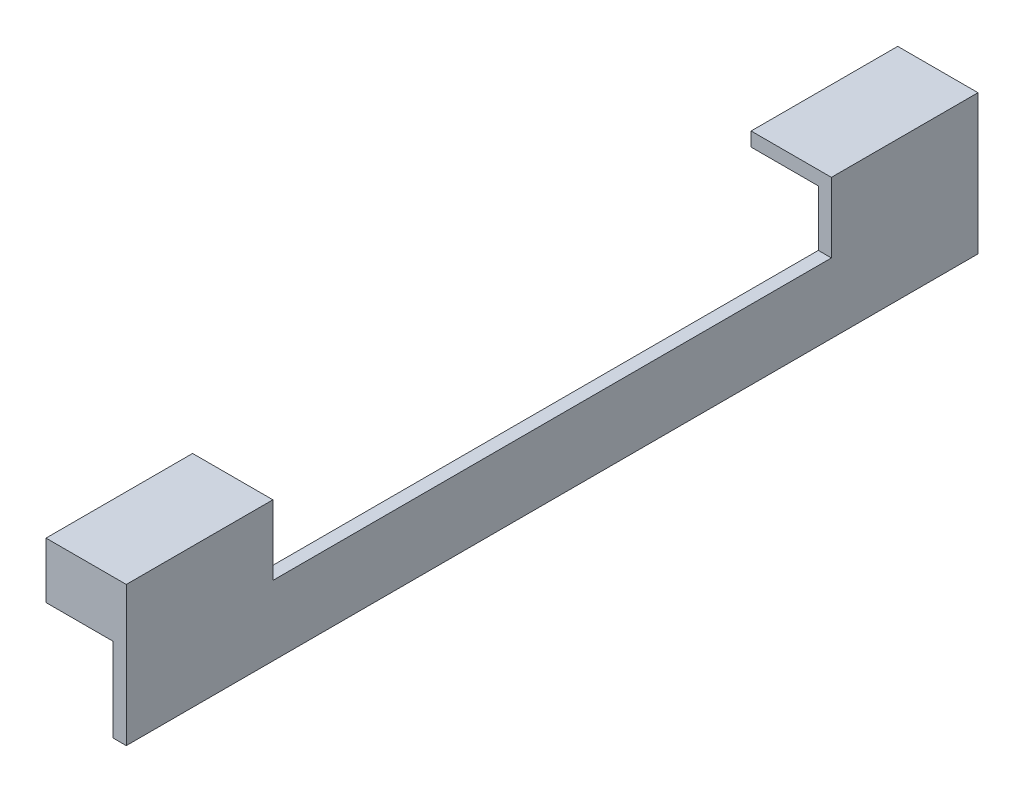
ISO-10303-21;
HEADER;
FILE_DESCRIPTION(('STEP AP214'),'2;1');
FILE_NAME('part.step','',(''),(''),'','','');
FILE_SCHEMA(('AUTOMOTIVE_DESIGN { 1 0 10303 214 1 1 1 1 }'));
ENDSEC;
DATA;
#1=APPLICATION_CONTEXT('core data for automotive mechanical design processes');
#2=APPLICATION_PROTOCOL_DEFINITION('international standard','automotive_design',2000,#1);
#3=PRODUCT_CONTEXT('',#1,'mechanical');
#4=PRODUCT('Part','Part','',(#3));
#5=PRODUCT_RELATED_PRODUCT_CATEGORY('part','',(#4));
#6=PRODUCT_DEFINITION_FORMATION('','',#4);
#7=PRODUCT_DEFINITION_CONTEXT('part definition',#1,'design');
#8=PRODUCT_DEFINITION('design','',#6,#7);
#9=PRODUCT_DEFINITION_SHAPE('','',#8);
#10=(LENGTH_UNIT() NAMED_UNIT(*) SI_UNIT(.MILLI.,.METRE.));
#11=(NAMED_UNIT(*) PLANE_ANGLE_UNIT() SI_UNIT($,.RADIAN.));
#12=(NAMED_UNIT(*) SI_UNIT($,.STERADIAN.) SOLID_ANGLE_UNIT());
#13=UNCERTAINTY_MEASURE_WITH_UNIT(LENGTH_MEASURE(1.E-05),#10,'distance_accuracy_value','');
#14=(GEOMETRIC_REPRESENTATION_CONTEXT(3) GLOBAL_UNCERTAINTY_ASSIGNED_CONTEXT((#13)) GLOBAL_UNIT_ASSIGNED_CONTEXT((#10,
#11,#12)) REPRESENTATION_CONTEXT('',''));
#15=CARTESIAN_POINT('',(0.,0.,0.));
#16=DIRECTION('',(0.,0.,1.));
#17=DIRECTION('',(1.,0.,0.));
#18=AXIS2_PLACEMENT_3D('',#15,#16,#17);
#19=CARTESIAN_POINT('',(105.0925,45.72,-154.94));
#20=DIRECTION('',(-1.,0.,0.));
#21=DIRECTION('',(0.,0.,1.));
#22=AXIS2_PLACEMENT_3D('',#19,#20,#21);
#23=PLANE('',#22);
#24=DIRECTION('',(0.,-1.,0.));
#25=VECTOR('',#24,1.);
#26=CARTESIAN_POINT('',(105.0925,50.8,101.6));
#27=LINE('',#26,#25);
#28=CARTESIAN_POINT('',(105.0925,50.8,101.6));
#29=VERTEX_POINT('',#28);
#30=CARTESIAN_POINT('',(105.0925,45.72,101.6));
#31=VERTEX_POINT('',#30);
#32=EDGE_CURVE('E232',#29,#31,#27,.T.);
#33=ORIENTED_EDGE('',*,*,#32,.T.);
#34=DIRECTION('',(0.,0.,1.));
#35=VECTOR('',#34,1.);
#36=CARTESIAN_POINT('',(105.0925,45.72,-154.94));
#37=LINE('',#36,#35);
#38=CARTESIAN_POINT('',(105.0925,45.72,150.1775));
#39=VERTEX_POINT('',#38);
#40=EDGE_CURVE('E183',#31,#39,#37,.T.);
#41=ORIENTED_EDGE('',*,*,#40,.T.);
#42=DIRECTION('',(0.,-1.,0.));
#43=VECTOR('',#42,1.);
#44=CARTESIAN_POINT('',(105.0925,50.8,150.1775));
#45=LINE('',#44,#43);
#46=CARTESIAN_POINT('',(105.0925,30.48,150.1775));
#47=VERTEX_POINT('',#46);
#48=EDGE_CURVE('E266',#39,#47,#45,.T.);
#49=ORIENTED_EDGE('',*,*,#48,.T.);
#50=DIRECTION('',(0.,0.,1.));
#51=VECTOR('',#50,1.);
#52=CARTESIAN_POINT('',(105.0925,30.48,150.1775));
#53=LINE('',#52,#51);
#54=CARTESIAN_POINT('',(105.0925,30.48,154.94));
#55=VERTEX_POINT('',#54);
#56=EDGE_CURVE('E259',#47,#55,#53,.T.);
#57=ORIENTED_EDGE('',*,*,#56,.T.);
#58=DIRECTION('',(0.,-1.,0.));
#59=VECTOR('',#58,1.);
#60=CARTESIAN_POINT('',(105.0925,45.72,154.94));
#61=LINE('',#60,#59);
#62=CARTESIAN_POINT('',(105.0925,50.8,154.94));
#63=VERTEX_POINT('',#62);
#64=EDGE_CURVE('E195',#63,#55,#61,.T.);
#65=ORIENTED_EDGE('',*,*,#64,.F.);
#66=DIRECTION('',(0.,0.,1.));
#67=VECTOR('',#66,1.);
#68=CARTESIAN_POINT('',(105.0925,50.8,-154.94));
#69=LINE('',#68,#67);
#70=EDGE_CURVE('E181',#29,#63,#69,.T.);
#71=ORIENTED_EDGE('',*,*,#70,.F.);
#72=EDGE_LOOP('',(#33,#41,#49,#57,#65,#71));
#73=FACE_BOUND('',#72,.T.);
#74=ADVANCED_FACE('F37',(#73),#23,.T.);
#75=CARTESIAN_POINT('',(0.,0.,-101.6));
#76=DIRECTION('',(0.,0.,1.));
#77=DIRECTION('',(1.,0.,0.));
#78=AXIS2_PLACEMENT_3D('',#75,#76,#77);
#79=PLANE('',#78);
#80=DIRECTION('',(0.,1.,0.));
#81=VECTOR('',#80,1.);
#82=CARTESIAN_POINT('',(129.54,0.,-101.6));
#83=LINE('',#82,#81);
#84=CARTESIAN_POINT('',(129.54,25.4,-101.6));
#85=VERTEX_POINT('',#84);
#86=CARTESIAN_POINT('',(129.54,45.72,-101.6));
#87=VERTEX_POINT('',#86);
#88=EDGE_CURVE('E214',#85,#87,#83,.T.);
#89=ORIENTED_EDGE('',*,*,#88,.F.);
#90=DIRECTION('',(1.,0.,0.));
#91=VECTOR('',#90,1.);
#92=CARTESIAN_POINT('',(105.0925,25.4,-101.6));
#93=LINE('',#92,#91);
#94=CARTESIAN_POINT('',(134.3025,25.4,-101.6));
#95=VERTEX_POINT('',#94);
#96=EDGE_CURVE('E153',#85,#95,#93,.T.);
#97=ORIENTED_EDGE('',*,*,#96,.T.);
#98=DIRECTION('',(0.,1.,0.));
#99=VECTOR('',#98,1.);
#100=CARTESIAN_POINT('',(134.3025,25.4,-101.6));
#101=LINE('',#100,#99);
#102=CARTESIAN_POINT('',(134.3025,50.8,-101.6));
#103=VERTEX_POINT('',#102);
#104=EDGE_CURVE('E147',#95,#103,#101,.T.);
#105=ORIENTED_EDGE('',*,*,#104,.T.);
#106=DIRECTION('',(-1.,0.,0.));
#107=VECTOR('',#106,1.);
#108=CARTESIAN_POINT('',(134.3025,50.8,-101.6));
#109=LINE('',#108,#107);
#110=CARTESIAN_POINT('',(105.0925,50.8,-101.6));
#111=VERTEX_POINT('',#110);
#112=EDGE_CURVE('E150',#103,#111,#109,.T.);
#113=ORIENTED_EDGE('',*,*,#112,.T.);
#114=DIRECTION('',(0.,-1.,0.));
#115=VECTOR('',#114,1.);
#116=CARTESIAN_POINT('',(105.0925,50.8,-101.6));
#117=LINE('',#116,#115);
#118=CARTESIAN_POINT('',(105.0925,45.72,-101.6));
#119=VERTEX_POINT('',#118);
#120=EDGE_CURVE('E167',#111,#119,#117,.T.);
#121=ORIENTED_EDGE('',*,*,#120,.T.);
#122=DIRECTION('',(-1.,0.,0.));
#123=VECTOR('',#122,1.);
#124=CARTESIAN_POINT('',(129.54,45.72,-101.6));
#125=LINE('',#124,#123);
#126=EDGE_CURVE('E52',#87,#119,#125,.T.);
#127=ORIENTED_EDGE('',*,*,#126,.F.);
#128=EDGE_LOOP('',(#89,#97,#105,#113,#121,#127));
#129=FACE_BOUND('',#128,.T.);
#130=ADVANCED_FACE('F149',(#129),#79,.T.);
#131=CARTESIAN_POINT('',(105.0925,50.8,-154.94));
#132=DIRECTION('',(0.,1.,0.));
#133=DIRECTION('',(-1.,0.,0.));
#134=AXIS2_PLACEMENT_3D('',#131,#132,#133);
#135=PLANE('',#134);
#136=CARTESIAN_POINT('',(105.0925,50.8,-154.94));
#137=VERTEX_POINT('',#136);
#138=EDGE_CURVE('E166',#137,#111,#69,.T.);
#139=ORIENTED_EDGE('',*,*,#138,.T.);
#140=ORIENTED_EDGE('',*,*,#112,.F.);
#141=DIRECTION('',(0.,0.,1.));
#142=VECTOR('',#141,1.);
#143=CARTESIAN_POINT('',(134.3025,50.8,-154.94));
#144=LINE('',#143,#142);
#145=CARTESIAN_POINT('',(134.3025,50.8,-154.94));
#146=VERTEX_POINT('',#145);
#147=EDGE_CURVE('E164',#146,#103,#144,.T.);
#148=ORIENTED_EDGE('',*,*,#147,.F.);
#149=DIRECTION('',(-1.,0.,0.));
#150=VECTOR('',#149,1.);
#151=CARTESIAN_POINT('',(105.0925,50.8,-154.94));
#152=LINE('',#151,#150);
#153=EDGE_CURVE('E186',#146,#137,#152,.T.);
#154=ORIENTED_EDGE('',*,*,#153,.T.);
#155=EDGE_LOOP('',(#139,#140,#148,#154));
#156=FACE_BOUND('',#155,.T.);
#157=ADVANCED_FACE('F162',(#156),#135,.T.);
#158=CARTESIAN_POINT('',(0.,0.,-154.94));
#159=DIRECTION('',(0.,0.,-1.));
#160=DIRECTION('',(-1.,0.,0.));
#161=AXIS2_PLACEMENT_3D('',#158,#159,#160);
#162=PLANE('',#161);
#163=DIRECTION('',(0.,-1.,0.));
#164=VECTOR('',#163,1.);
#165=CARTESIAN_POINT('',(129.54,0.,-154.94));
#166=LINE('',#165,#164);
#167=CARTESIAN_POINT('',(129.54,30.48,-154.94));
#168=VERTEX_POINT('',#167);
#169=CARTESIAN_POINT('',(129.54,0.,-154.94));
#170=VERTEX_POINT('',#169);
#171=EDGE_CURVE('E193',#168,#170,#166,.T.);
#172=ORIENTED_EDGE('',*,*,#171,.F.);
#173=DIRECTION('',(-1.,0.,0.));
#174=VECTOR('',#173,1.);
#175=CARTESIAN_POINT('',(105.0925,30.48,-154.94));
#176=LINE('',#175,#174);
#177=CARTESIAN_POINT('',(105.0925,30.48,-154.94));
#178=VERTEX_POINT('',#177);
#179=EDGE_CURVE('E247',#168,#178,#176,.T.);
#180=ORIENTED_EDGE('',*,*,#179,.T.);
#181=DIRECTION('',(0.,-1.,0.));
#182=VECTOR('',#181,1.);
#183=CARTESIAN_POINT('',(105.0925,45.72,-154.94));
#184=LINE('',#183,#182);
#185=EDGE_CURVE('E184',#137,#178,#184,.T.);
#186=ORIENTED_EDGE('',*,*,#185,.F.);
#187=ORIENTED_EDGE('',*,*,#153,.F.);
#188=DIRECTION('',(0.,1.,0.));
#189=VECTOR('',#188,1.);
#190=CARTESIAN_POINT('',(134.3025,50.8,-154.94));
#191=LINE('',#190,#189);
#192=CARTESIAN_POINT('',(134.3025,0.,-154.94));
#193=VERTEX_POINT('',#192);
#194=EDGE_CURVE('E172',#193,#146,#191,.T.);
#195=ORIENTED_EDGE('',*,*,#194,.F.);
#196=DIRECTION('',(1.,0.,0.));
#197=VECTOR('',#196,1.);
#198=CARTESIAN_POINT('',(134.3025,0.,-154.94));
#199=LINE('',#198,#197);
#200=EDGE_CURVE('E190',#170,#193,#199,.T.);
#201=ORIENTED_EDGE('',*,*,#200,.F.);
#202=EDGE_LOOP('',(#172,#180,#186,#187,#195,#201));
#203=FACE_BOUND('',#202,.T.);
#204=ADVANCED_FACE('F318',(#203),#162,.T.);
#205=CARTESIAN_POINT('',(105.0925,30.48,-150.1775));
#206=DIRECTION('',(0.,-1.,0.));
#207=DIRECTION('',(1.,0.,0.));
#208=AXIS2_PLACEMENT_3D('',#205,#206,#207);
#209=PLANE('',#208);
#210=ORIENTED_EDGE('',*,*,#179,.F.);
#211=DIRECTION('',(0.,0.,1.));
#212=VECTOR('',#211,1.);
#213=CARTESIAN_POINT('',(129.54,30.48,-154.94));
#214=LINE('',#213,#212);
#215=CARTESIAN_POINT('',(129.54,30.48,-150.1775));
#216=VERTEX_POINT('',#215);
#217=EDGE_CURVE('E250',#168,#216,#214,.T.);
#218=ORIENTED_EDGE('',*,*,#217,.T.);
#219=DIRECTION('',(-1.,0.,0.));
#220=VECTOR('',#219,1.);
#221=CARTESIAN_POINT('',(105.0925,30.48,-150.1775));
#222=LINE('',#221,#220);
#223=CARTESIAN_POINT('',(105.0925,30.48,-150.1775));
#224=VERTEX_POINT('',#223);
#225=EDGE_CURVE('E251',#216,#224,#222,.T.);
#226=ORIENTED_EDGE('',*,*,#225,.T.);
#227=DIRECTION('',(0.,0.,-1.));
#228=VECTOR('',#227,1.);
#229=CARTESIAN_POINT('',(105.0925,30.48,-150.1775));
#230=LINE('',#229,#228);
#231=EDGE_CURVE('E243',#224,#178,#230,.T.);
#232=ORIENTED_EDGE('',*,*,#231,.T.);
#233=EDGE_LOOP('',(#210,#218,#226,#232));
#234=FACE_BOUND('',#233,.T.);
#235=ADVANCED_FACE('F315',(#234),#209,.T.);
#236=CARTESIAN_POINT('',(129.54,45.72,-154.94));
#237=DIRECTION('',(0.,-1.,0.));
#238=DIRECTION('',(0.,0.,-1.));
#239=AXIS2_PLACEMENT_3D('',#236,#237,#238);
#240=PLANE('',#239);
#241=DIRECTION('',(0.,0.,1.));
#242=VECTOR('',#241,1.);
#243=CARTESIAN_POINT('',(129.54,45.72,-154.94));
#244=LINE('',#243,#242);
#245=CARTESIAN_POINT('',(129.54,45.72,-150.1775));
#246=VERTEX_POINT('',#245);
#247=EDGE_CURVE('E187',#246,#87,#244,.T.);
#248=ORIENTED_EDGE('',*,*,#247,.T.);
#249=ORIENTED_EDGE('',*,*,#126,.T.);
#250=CARTESIAN_POINT('',(105.0925,45.72,-150.1775));
#251=VERTEX_POINT('',#250);
#252=EDGE_CURVE('E59',#251,#119,#37,.T.);
#253=ORIENTED_EDGE('',*,*,#252,.F.);
#254=DIRECTION('',(-1.,0.,0.));
#255=VECTOR('',#254,1.);
#256=CARTESIAN_POINT('',(129.54,45.72,-150.1775));
#257=LINE('',#256,#255);
#258=EDGE_CURVE('E257',#246,#251,#257,.T.);
#259=ORIENTED_EDGE('',*,*,#258,.F.);
#260=EDGE_LOOP('',(#248,#249,#253,#259));
#261=FACE_BOUND('',#260,.T.);
#262=ADVANCED_FACE('F305',(#261),#240,.T.);
#263=CARTESIAN_POINT('',(105.0925,25.4,101.6));
#264=DIRECTION('',(0.,1.,0.));
#265=DIRECTION('',(0.,0.,1.));
#266=AXIS2_PLACEMENT_3D('',#263,#264,#265);
#267=PLANE('',#266);
#268=DIRECTION('',(1.,0.,0.));
#269=VECTOR('',#268,1.);
#270=CARTESIAN_POINT('',(105.0925,25.4,101.6));
#271=LINE('',#270,#269);
#272=CARTESIAN_POINT('',(129.54,25.4,101.6));
#273=VERTEX_POINT('',#272);
#274=CARTESIAN_POINT('',(134.3025,25.4,101.6));
#275=VERTEX_POINT('',#274);
#276=EDGE_CURVE('E225',#273,#275,#271,.T.);
#277=ORIENTED_EDGE('',*,*,#276,.T.);
#278=DIRECTION('',(0.,0.,-1.));
#279=VECTOR('',#278,1.);
#280=CARTESIAN_POINT('',(134.3025,25.4,101.6));
#281=LINE('',#280,#279);
#282=EDGE_CURVE('E231',#275,#95,#281,.T.);
#283=ORIENTED_EDGE('',*,*,#282,.T.);
#284=ORIENTED_EDGE('',*,*,#96,.F.);
#285=DIRECTION('',(0.,0.,-1.));
#286=VECTOR('',#285,1.);
#287=CARTESIAN_POINT('',(129.54,25.4,-154.94));
#288=LINE('',#287,#286);
#289=EDGE_CURVE('E45',#273,#85,#288,.T.);
#290=ORIENTED_EDGE('',*,*,#289,.F.);
#291=EDGE_LOOP('',(#277,#283,#284,#290));
#292=FACE_BOUND('',#291,.T.);
#293=ADVANCED_FACE('F224',(#292),#267,.T.);
#294=DIRECTION('',(-1.,0.,0.));
#295=VECTOR('',#294,1.);
#296=CARTESIAN_POINT('',(129.54,45.72,101.6));
#297=LINE('',#296,#295);
#298=CARTESIAN_POINT('',(129.54,45.72,101.6));
#299=VERTEX_POINT('',#298);
#300=EDGE_CURVE('E241',#299,#31,#297,.T.);
#301=ORIENTED_EDGE('',*,*,#300,.F.);
#302=CARTESIAN_POINT('',(129.54,45.72,150.1775));
#303=VERTEX_POINT('',#302);
#304=EDGE_CURVE('E275',#299,#303,#244,.T.);
#305=ORIENTED_EDGE('',*,*,#304,.T.);
#306=DIRECTION('',(-1.,0.,0.));
#307=VECTOR('',#306,1.);
#308=CARTESIAN_POINT('',(129.54,45.72,150.1775));
#309=LINE('',#308,#307);
#310=EDGE_CURVE('E272',#303,#39,#309,.T.);
#311=ORIENTED_EDGE('',*,*,#310,.T.);
#312=ORIENTED_EDGE('',*,*,#40,.F.);
#313=EDGE_LOOP('',(#301,#305,#311,#312));
#314=FACE_BOUND('',#313,.T.);
#315=ADVANCED_FACE('F282',(#314),#240,.T.);
#316=CARTESIAN_POINT('',(0.,0.,150.1775));
#317=DIRECTION('',(0.,0.,1.));
#318=DIRECTION('',(1.,0.,0.));
#319=AXIS2_PLACEMENT_3D('',#316,#317,#318);
#320=PLANE('',#319);
#321=ORIENTED_EDGE('',*,*,#310,.F.);
#322=DIRECTION('',(0.,1.,0.));
#323=VECTOR('',#322,1.);
#324=CARTESIAN_POINT('',(129.54,0.,150.1775));
#325=LINE('',#324,#323);
#326=CARTESIAN_POINT('',(129.54,30.48,150.1775));
#327=VERTEX_POINT('',#326);
#328=EDGE_CURVE('E208',#327,#303,#325,.T.);
#329=ORIENTED_EDGE('',*,*,#328,.F.);
#330=DIRECTION('',(1.,0.,0.));
#331=VECTOR('',#330,1.);
#332=CARTESIAN_POINT('',(105.0925,30.48,150.1775));
#333=LINE('',#332,#331);
#334=EDGE_CURVE('E262',#47,#327,#333,.T.);
#335=ORIENTED_EDGE('',*,*,#334,.F.);
#336=ORIENTED_EDGE('',*,*,#48,.F.);
#337=EDGE_LOOP('',(#321,#329,#335,#336));
#338=FACE_BOUND('',#337,.T.);
#339=ADVANCED_FACE('F286',(#338),#320,.F.);
#340=CARTESIAN_POINT('',(134.3025,0.,-154.94));
#341=DIRECTION('',(0.,-1.,0.));
#342=DIRECTION('',(0.,0.,-1.));
#343=AXIS2_PLACEMENT_3D('',#340,#341,#342);
#344=PLANE('',#343);
#345=DIRECTION('',(0.,0.,1.));
#346=VECTOR('',#345,1.);
#347=CARTESIAN_POINT('',(134.3025,0.,-154.94));
#348=LINE('',#347,#346);
#349=CARTESIAN_POINT('',(134.3025,0.,154.94));
#350=VERTEX_POINT('',#349);
#351=EDGE_CURVE('E173',#193,#350,#348,.T.);
#352=ORIENTED_EDGE('',*,*,#351,.T.);
#353=DIRECTION('',(1.,0.,0.));
#354=VECTOR('',#353,1.);
#355=CARTESIAN_POINT('',(134.3025,0.,154.94));
#356=LINE('',#355,#354);
#357=CARTESIAN_POINT('',(129.54,0.,154.94));
#358=VERTEX_POINT('',#357);
#359=EDGE_CURVE('E203',#358,#350,#356,.T.);
#360=ORIENTED_EDGE('',*,*,#359,.F.);
#361=DIRECTION('',(0.,0.,1.));
#362=VECTOR('',#361,1.);
#363=CARTESIAN_POINT('',(129.54,0.,-154.94));
#364=LINE('',#363,#362);
#365=EDGE_CURVE('E176',#170,#358,#364,.T.);
#366=ORIENTED_EDGE('',*,*,#365,.F.);
#367=ORIENTED_EDGE('',*,*,#200,.T.);
#368=EDGE_LOOP('',(#352,#360,#366,#367));
#369=FACE_BOUND('',#368,.T.);
#370=ADVANCED_FACE('F321',(#369),#344,.T.);
#371=CARTESIAN_POINT('',(129.54,0.,-154.94));
#372=DIRECTION('',(-1.,0.,0.));
#373=DIRECTION('',(0.,0.,1.));
#374=AXIS2_PLACEMENT_3D('',#371,#372,#373);
#375=PLANE('',#374);
#376=DIRECTION('',(0.,1.,0.));
#377=VECTOR('',#376,1.);
#378=CARTESIAN_POINT('',(129.54,0.,101.6));
#379=LINE('',#378,#377);
#380=EDGE_CURVE('E11',#273,#299,#379,.T.);
#381=ORIENTED_EDGE('',*,*,#380,.F.);
#382=ORIENTED_EDGE('',*,*,#289,.T.);
#383=ORIENTED_EDGE('',*,*,#88,.T.);
#384=ORIENTED_EDGE('',*,*,#247,.F.);
#385=DIRECTION('',(0.,1.,0.));
#386=VECTOR('',#385,1.);
#387=CARTESIAN_POINT('',(129.54,0.,-150.1775));
#388=LINE('',#387,#386);
#389=EDGE_CURVE('E211',#216,#246,#388,.T.);
#390=ORIENTED_EDGE('',*,*,#389,.F.);
#391=ORIENTED_EDGE('',*,*,#217,.F.);
#392=ORIENTED_EDGE('',*,*,#171,.T.);
#393=ORIENTED_EDGE('',*,*,#365,.T.);
#394=DIRECTION('',(0.,-1.,0.));
#395=VECTOR('',#394,1.);
#396=CARTESIAN_POINT('',(129.54,0.,154.94));
#397=LINE('',#396,#395);
#398=CARTESIAN_POINT('',(129.54,30.48,154.94));
#399=VERTEX_POINT('',#398);
#400=EDGE_CURVE('E206',#399,#358,#397,.T.);
#401=ORIENTED_EDGE('',*,*,#400,.F.);
#402=DIRECTION('',(0.,0.,1.));
#403=VECTOR('',#402,1.);
#404=CARTESIAN_POINT('',(129.54,30.48,-154.94));
#405=LINE('',#404,#403);
#406=EDGE_CURVE('E265',#327,#399,#405,.T.);
#407=ORIENTED_EDGE('',*,*,#406,.F.);
#408=ORIENTED_EDGE('',*,*,#328,.T.);
#409=ORIENTED_EDGE('',*,*,#304,.F.);
#410=EDGE_LOOP('',(#381,#382,#383,#384,#390,#391,#392,#393,#401,#407,#408,#409));
#411=FACE_BOUND('',#410,.T.);
#412=ADVANCED_FACE('F218',(#411),#375,.T.);
#413=CARTESIAN_POINT('',(105.0925,30.48,150.1775));
#414=DIRECTION('',(0.,-1.,0.));
#415=DIRECTION('',(0.,0.,-1.));
#416=AXIS2_PLACEMENT_3D('',#413,#414,#415);
#417=PLANE('',#416);
#418=ORIENTED_EDGE('',*,*,#334,.T.);
#419=ORIENTED_EDGE('',*,*,#406,.T.);
#420=DIRECTION('',(1.,0.,0.));
#421=VECTOR('',#420,1.);
#422=CARTESIAN_POINT('',(105.0925,30.48,154.94));
#423=LINE('',#422,#421);
#424=EDGE_CURVE('E263',#55,#399,#423,.T.);
#425=ORIENTED_EDGE('',*,*,#424,.F.);
#426=ORIENTED_EDGE('',*,*,#56,.F.);
#427=EDGE_LOOP('',(#418,#419,#425,#426));
#428=FACE_BOUND('',#427,.T.);
#429=ADVANCED_FACE('F291',(#428),#417,.T.);
#430=CARTESIAN_POINT('',(134.3025,50.8,-154.94));
#431=DIRECTION('',(1.,0.,0.));
#432=DIRECTION('',(0.,0.,-1.));
#433=AXIS2_PLACEMENT_3D('',#430,#431,#432);
#434=PLANE('',#433);
#435=DIRECTION('',(0.,1.,0.));
#436=VECTOR('',#435,1.);
#437=CARTESIAN_POINT('',(134.3025,25.4,101.6));
#438=LINE('',#437,#436);
#439=CARTESIAN_POINT('',(134.3025,50.8,101.6));
#440=VERTEX_POINT('',#439);
#441=EDGE_CURVE('E230',#275,#440,#438,.T.);
#442=ORIENTED_EDGE('',*,*,#441,.T.);
#443=CARTESIAN_POINT('',(134.3025,50.8,154.94));
#444=VERTEX_POINT('',#443);
#445=EDGE_CURVE('E174',#440,#444,#144,.T.);
#446=ORIENTED_EDGE('',*,*,#445,.T.);
#447=DIRECTION('',(0.,1.,0.));
#448=VECTOR('',#447,1.);
#449=CARTESIAN_POINT('',(134.3025,50.8,154.94));
#450=LINE('',#449,#448);
#451=EDGE_CURVE('E200',#350,#444,#450,.T.);
#452=ORIENTED_EDGE('',*,*,#451,.F.);
#453=ORIENTED_EDGE('',*,*,#351,.F.);
#454=ORIENTED_EDGE('',*,*,#194,.T.);
#455=ORIENTED_EDGE('',*,*,#147,.T.);
#456=ORIENTED_EDGE('',*,*,#104,.F.);
#457=ORIENTED_EDGE('',*,*,#282,.F.);
#458=EDGE_LOOP('',(#442,#446,#452,#453,#454,#455,#456,#457));
#459=FACE_BOUND('',#458,.T.);
#460=ADVANCED_FACE('F170',(#459),#434,.T.);
#461=CARTESIAN_POINT('',(0.,0.,154.94));
#462=DIRECTION('',(0.,0.,-1.));
#463=DIRECTION('',(-1.,0.,0.));
#464=AXIS2_PLACEMENT_3D('',#461,#462,#463);
#465=PLANE('',#464);
#466=ORIENTED_EDGE('',*,*,#451,.T.);
#467=DIRECTION('',(-1.,0.,0.));
#468=VECTOR('',#467,1.);
#469=CARTESIAN_POINT('',(105.0925,50.8,154.94));
#470=LINE('',#469,#468);
#471=EDGE_CURVE('E197',#444,#63,#470,.T.);
#472=ORIENTED_EDGE('',*,*,#471,.T.);
#473=ORIENTED_EDGE('',*,*,#64,.T.);
#474=ORIENTED_EDGE('',*,*,#424,.T.);
#475=ORIENTED_EDGE('',*,*,#400,.T.);
#476=ORIENTED_EDGE('',*,*,#359,.T.);
#477=EDGE_LOOP('',(#466,#472,#473,#474,#475,#476));
#478=FACE_BOUND('',#477,.T.);
#479=ADVANCED_FACE('F39',(#478),#465,.F.);
#480=CARTESIAN_POINT('',(0.,0.,101.6));
#481=DIRECTION('',(0.,0.,1.));
#482=DIRECTION('',(1.,0.,0.));
#483=AXIS2_PLACEMENT_3D('',#480,#481,#482);
#484=PLANE('',#483);
#485=ORIENTED_EDGE('',*,*,#300,.T.);
#486=ORIENTED_EDGE('',*,*,#32,.F.);
#487=DIRECTION('',(-1.,0.,0.));
#488=VECTOR('',#487,1.);
#489=CARTESIAN_POINT('',(134.3025,50.8,101.6));
#490=LINE('',#489,#488);
#491=EDGE_CURVE('E236',#440,#29,#490,.T.);
#492=ORIENTED_EDGE('',*,*,#491,.F.);
#493=ORIENTED_EDGE('',*,*,#441,.F.);
#494=ORIENTED_EDGE('',*,*,#276,.F.);
#495=ORIENTED_EDGE('',*,*,#380,.T.);
#496=EDGE_LOOP('',(#485,#486,#492,#493,#494,#495));
#497=FACE_BOUND('',#496,.T.);
#498=ADVANCED_FACE('F228',(#497),#484,.F.);
#499=ORIENTED_EDGE('',*,*,#491,.T.);
#500=ORIENTED_EDGE('',*,*,#70,.T.);
#501=ORIENTED_EDGE('',*,*,#471,.F.);
#502=ORIENTED_EDGE('',*,*,#445,.F.);
#503=EDGE_LOOP('',(#499,#500,#501,#502));
#504=FACE_BOUND('',#503,.T.);
#505=ADVANCED_FACE('F299',(#504),#135,.T.);
#506=CARTESIAN_POINT('',(0.,0.,-150.1775));
#507=DIRECTION('',(0.,0.,1.));
#508=DIRECTION('',(1.,0.,0.));
#509=AXIS2_PLACEMENT_3D('',#506,#507,#508);
#510=PLANE('',#509);
#511=ORIENTED_EDGE('',*,*,#389,.T.);
#512=ORIENTED_EDGE('',*,*,#258,.T.);
#513=DIRECTION('',(0.,1.,0.));
#514=VECTOR('',#513,1.);
#515=CARTESIAN_POINT('',(105.0925,50.8,-150.1775));
#516=LINE('',#515,#514);
#517=EDGE_CURVE('E246',#224,#251,#516,.T.);
#518=ORIENTED_EDGE('',*,*,#517,.F.);
#519=ORIENTED_EDGE('',*,*,#225,.F.);
#520=EDGE_LOOP('',(#511,#512,#518,#519));
#521=FACE_BOUND('',#520,.T.);
#522=ADVANCED_FACE('F311',(#521),#510,.T.);
#523=ORIENTED_EDGE('',*,*,#252,.T.);
#524=ORIENTED_EDGE('',*,*,#120,.F.);
#525=ORIENTED_EDGE('',*,*,#138,.F.);
#526=ORIENTED_EDGE('',*,*,#185,.T.);
#527=ORIENTED_EDGE('',*,*,#231,.F.);
#528=ORIENTED_EDGE('',*,*,#517,.T.);
#529=EDGE_LOOP('',(#523,#524,#525,#526,#527,#528));
#530=FACE_BOUND('',#529,.T.);
#531=ADVANCED_FACE('F306',(#530),#23,.T.);
#532=CLOSED_SHELL('',(#74,#130,#157,#204,#235,#262,#293,#315,#339,#370,#412,#429,#460,#479,#498,
#505,#522,#531));
#533=MANIFOLD_SOLID_BREP('B2',#532);
#534=ADVANCED_BREP_SHAPE_REPRESENTATION('',(#18,#533),#14);
#535=SHAPE_DEFINITION_REPRESENTATION(#9,#534);
ENDSEC;
END-ISO-10303-21;
